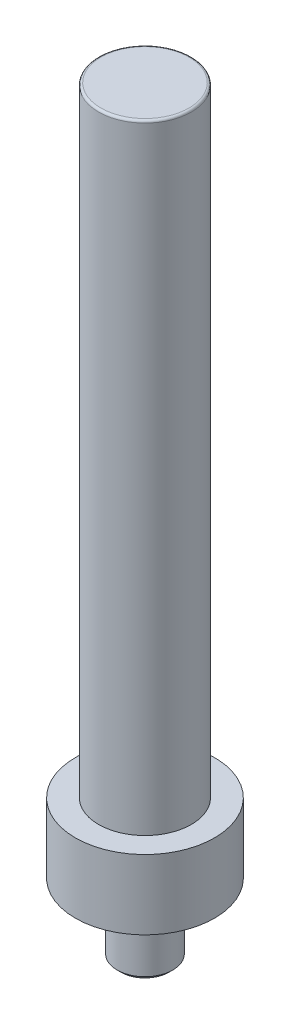
ISO-10303-21;
HEADER;
FILE_DESCRIPTION(('STEP AP214'),'2;1');
FILE_NAME('part.step','',(''),(''),'','','');
FILE_SCHEMA(('AUTOMOTIVE_DESIGN { 1 0 10303 214 1 1 1 1 }'));
ENDSEC;
DATA;
#1=APPLICATION_CONTEXT('core data for automotive mechanical design processes');
#2=APPLICATION_PROTOCOL_DEFINITION('international standard','automotive_design',2000,#1);
#3=PRODUCT_CONTEXT('',#1,'mechanical');
#4=PRODUCT('Part','Part','',(#3));
#5=PRODUCT_RELATED_PRODUCT_CATEGORY('part','',(#4));
#6=PRODUCT_DEFINITION_FORMATION('','',#4);
#7=PRODUCT_DEFINITION_CONTEXT('part definition',#1,'design');
#8=PRODUCT_DEFINITION('design','',#6,#7);
#9=PRODUCT_DEFINITION_SHAPE('','',#8);
#10=(LENGTH_UNIT() NAMED_UNIT(*) SI_UNIT(.MILLI.,.METRE.));
#11=(NAMED_UNIT(*) PLANE_ANGLE_UNIT() SI_UNIT($,.RADIAN.));
#12=(NAMED_UNIT(*) SI_UNIT($,.STERADIAN.) SOLID_ANGLE_UNIT());
#13=UNCERTAINTY_MEASURE_WITH_UNIT(LENGTH_MEASURE(1.E-05),#10,'distance_accuracy_value','');
#14=(GEOMETRIC_REPRESENTATION_CONTEXT(3) GLOBAL_UNCERTAINTY_ASSIGNED_CONTEXT((#13)) GLOBAL_UNIT_ASSIGNED_CONTEXT((#10,
#11,#12)) REPRESENTATION_CONTEXT('',''));
#15=CARTESIAN_POINT('',(0.,0.,0.));
#16=DIRECTION('',(0.,0.,1.));
#17=DIRECTION('',(1.,0.,0.));
#18=AXIS2_PLACEMENT_3D('',#15,#16,#17);
#19=CARTESIAN_POINT('',(0.,15.,0.));
#20=DIRECTION('',(0.,-1.,0.));
#21=DIRECTION('',(0.,0.,-1.));
#22=AXIS2_PLACEMENT_3D('',#19,#20,#21);
#23=CYLINDRICAL_SURFACE('',#22,15.);
#24=CARTESIAN_POINT('',(0.,15.,0.));
#25=DIRECTION('',(0.,1.,0.));
#26=DIRECTION('',(0.,0.,1.));
#27=AXIS2_PLACEMENT_3D('',#24,#25,#26);
#28=CIRCLE('',#27,15.);
#29=CARTESIAN_POINT('',(0.,15.,15.));
#30=VERTEX_POINT('',#29);
#31=EDGE_CURVE('E64',#30,#30,#28,.T.);
#32=ORIENTED_EDGE('',*,*,#31,.F.);
#33=EDGE_LOOP('',(#32));
#34=FACE_BOUND('',#33,.T.);
#35=CARTESIAN_POINT('',(0.,0.,0.));
#36=DIRECTION('',(0.,1.,0.));
#37=DIRECTION('',(0.,0.,1.));
#38=AXIS2_PLACEMENT_3D('',#35,#36,#37);
#39=CIRCLE('',#38,15.);
#40=CARTESIAN_POINT('',(0.,0.,15.));
#41=VERTEX_POINT('',#40);
#42=EDGE_CURVE('E67',#41,#41,#39,.T.);
#43=ORIENTED_EDGE('',*,*,#42,.T.);
#44=EDGE_LOOP('',(#43));
#45=FACE_BOUND('',#44,.T.);
#46=ADVANCED_FACE('F44',(#34,#45),#23,.T.);
#47=CARTESIAN_POINT('',(0.,15.,0.));
#48=DIRECTION('',(0.,1.,0.));
#49=DIRECTION('',(0.,0.,1.));
#50=AXIS2_PLACEMENT_3D('',#47,#48,#49);
#51=PLANE('',#50);
#52=CARTESIAN_POINT('',(0.,15.,0.));
#53=DIRECTION('',(0.,1.,0.));
#54=DIRECTION('',(0.,0.,1.));
#55=AXIS2_PLACEMENT_3D('',#52,#53,#54);
#56=CIRCLE('',#55,10.);
#57=CARTESIAN_POINT('',(0.,15.,10.));
#58=VERTEX_POINT('',#57);
#59=EDGE_CURVE('E58',#58,#58,#56,.T.);
#60=ORIENTED_EDGE('',*,*,#59,.F.);
#61=EDGE_LOOP('',(#60));
#62=FACE_BOUND('',#61,.T.);
#63=ORIENTED_EDGE('',*,*,#31,.T.);
#64=EDGE_LOOP('',(#63));
#65=FACE_BOUND('',#64,.T.);
#66=ADVANCED_FACE('F106',(#62,#65),#51,.T.);
#67=CARTESIAN_POINT('',(0.,0.,0.));
#68=DIRECTION('',(0.,1.,0.));
#69=DIRECTION('',(0.,0.,1.));
#70=AXIS2_PLACEMENT_3D('',#67,#68,#69);
#71=PLANE('',#70);
#72=ORIENTED_EDGE('',*,*,#42,.F.);
#73=EDGE_LOOP('',(#72));
#74=FACE_BOUND('',#73,.T.);
#75=CARTESIAN_POINT('',(0.,0.,0.));
#76=DIRECTION('',(0.,1.,0.));
#77=DIRECTION('',(0.,0.,1.));
#78=AXIS2_PLACEMENT_3D('',#75,#76,#77);
#79=CIRCLE('',#78,6.);
#80=CARTESIAN_POINT('',(0.,0.,6.));
#81=VERTEX_POINT('',#80);
#82=EDGE_CURVE('E71',#81,#81,#79,.T.);
#83=ORIENTED_EDGE('',*,*,#82,.T.);
#84=EDGE_LOOP('',(#83));
#85=FACE_BOUND('',#84,.T.);
#86=ADVANCED_FACE('F111',(#74,#85),#71,.F.);
#87=CARTESIAN_POINT('',(0.,148.5,0.));
#88=DIRECTION('',(0.,-1.,0.));
#89=DIRECTION('',(0.,0.,-1.));
#90=AXIS2_PLACEMENT_3D('',#87,#88,#89);
#91=CYLINDRICAL_SURFACE('',#90,10.);
#92=CARTESIAN_POINT('',(0.,148.,0.));
#93=DIRECTION('',(0.,1.,0.));
#94=DIRECTION('',(0.,0.,1.));
#95=AXIS2_PLACEMENT_3D('',#92,#93,#94);
#96=CIRCLE('',#95,10.);
#97=CARTESIAN_POINT('',(0.,148.,10.));
#98=VERTEX_POINT('',#97);
#99=EDGE_CURVE('E10',#98,#98,#96,.F.);
#100=ORIENTED_EDGE('',*,*,#99,.T.);
#101=EDGE_LOOP('',(#100));
#102=FACE_BOUND('',#101,.T.);
#103=ORIENTED_EDGE('',*,*,#59,.T.);
#104=EDGE_LOOP('',(#103));
#105=FACE_BOUND('',#104,.T.);
#106=ADVANCED_FACE('F118',(#102,#105),#91,.T.);
#107=CARTESIAN_POINT('',(0.,148.5,0.));
#108=DIRECTION('',(0.,1.,0.));
#109=DIRECTION('',(0.,0.,1.));
#110=AXIS2_PLACEMENT_3D('',#107,#108,#109);
#111=PLANE('',#110);
#112=CARTESIAN_POINT('',(0.,148.5,0.));
#113=DIRECTION('',(0.,1.,0.));
#114=DIRECTION('',(0.,0.,1.));
#115=AXIS2_PLACEMENT_3D('',#112,#113,#114);
#116=CIRCLE('',#115,9.5);
#117=CARTESIAN_POINT('',(0.,148.5,9.5));
#118=VERTEX_POINT('',#117);
#119=EDGE_CURVE('E52',#118,#118,#116,.T.);
#120=ORIENTED_EDGE('',*,*,#119,.T.);
#121=EDGE_LOOP('',(#120));
#122=FACE_BOUND('',#121,.T.);
#123=ADVANCED_FACE('F122',(#122),#111,.T.);
#124=CARTESIAN_POINT('',(0.,-15.,0.));
#125=DIRECTION('',(0.,1.,0.));
#126=DIRECTION('',(0.,0.,1.));
#127=AXIS2_PLACEMENT_3D('',#124,#125,#126);
#128=CYLINDRICAL_SURFACE('',#127,6.);
#129=ORIENTED_EDGE('',*,*,#82,.F.);
#130=EDGE_LOOP('',(#129));
#131=FACE_BOUND('',#130,.T.);
#132=CARTESIAN_POINT('',(0.,-14.172,0.));
#133=DIRECTION('',(0.,1.,0.));
#134=DIRECTION('',(0.,0.,1.));
#135=AXIS2_PLACEMENT_3D('',#132,#133,#134);
#136=CIRCLE('',#135,6.);
#137=CARTESIAN_POINT('',(0.,-14.172,6.));
#138=VERTEX_POINT('',#137);
#139=EDGE_CURVE('E82',#138,#138,#136,.T.);
#140=ORIENTED_EDGE('',*,*,#139,.T.);
#141=EDGE_LOOP('',(#140));
#142=FACE_BOUND('',#141,.T.);
#143=ADVANCED_FACE('F88',(#131,#142),#128,.T.);
#144=CARTESIAN_POINT('',(0.,-15.,0.));
#145=DIRECTION('',(0.,1.,0.));
#146=DIRECTION('',(0.,0.,1.));
#147=AXIS2_PLACEMENT_3D('',#144,#145,#146);
#148=CONICAL_SURFACE('',#147,5.172,0.785398163397448);
#149=ORIENTED_EDGE('',*,*,#139,.F.);
#150=EDGE_LOOP('',(#149));
#151=FACE_BOUND('',#150,.T.);
#152=CARTESIAN_POINT('',(0.,-15.,0.));
#153=DIRECTION('',(0.,1.,0.));
#154=DIRECTION('',(0.,0.,1.));
#155=AXIS2_PLACEMENT_3D('',#152,#153,#154);
#156=CIRCLE('',#155,5.172);
#157=CARTESIAN_POINT('',(0.,-15.,5.172));
#158=VERTEX_POINT('',#157);
#159=EDGE_CURVE('E78',#158,#158,#156,.T.);
#160=ORIENTED_EDGE('',*,*,#159,.T.);
#161=EDGE_LOOP('',(#160));
#162=FACE_BOUND('',#161,.T.);
#163=ADVANCED_FACE('F90',(#151,#162),#148,.T.);
#164=CARTESIAN_POINT('',(0.,-15.,0.));
#165=DIRECTION('',(0.,-1.,0.));
#166=DIRECTION('',(0.,0.,-1.));
#167=AXIS2_PLACEMENT_3D('',#164,#165,#166);
#168=PLANE('',#167);
#169=ORIENTED_EDGE('',*,*,#159,.F.);
#170=EDGE_LOOP('',(#169));
#171=FACE_BOUND('',#170,.T.);
#172=ADVANCED_FACE('F93',(#171),#168,.T.);
#173=CARTESIAN_POINT('',(0.,148.,0.));
#174=DIRECTION('',(0.,1.,0.));
#175=DIRECTION('',(0.,0.,1.));
#176=AXIS2_PLACEMENT_3D('',#173,#174,#175);
#177=TOROIDAL_SURFACE('',#176,9.5,0.5);
#178=ORIENTED_EDGE('',*,*,#99,.F.);
#179=EDGE_LOOP('',(#178));
#180=FACE_BOUND('',#179,.T.);
#181=ORIENTED_EDGE('',*,*,#119,.F.);
#182=EDGE_LOOP('',(#181));
#183=FACE_BOUND('',#182,.T.);
#184=ADVANCED_FACE('F46',(#180,#183),#177,.T.);
#185=CLOSED_SHELL('',(#46,#66,#86,#106,#123,#143,#163,#172,#184));
#186=MANIFOLD_SOLID_BREP('B2',#185);
#187=ADVANCED_BREP_SHAPE_REPRESENTATION('',(#18,#186),#14);
#188=SHAPE_DEFINITION_REPRESENTATION(#9,#187);
ENDSEC;
END-ISO-10303-21;
